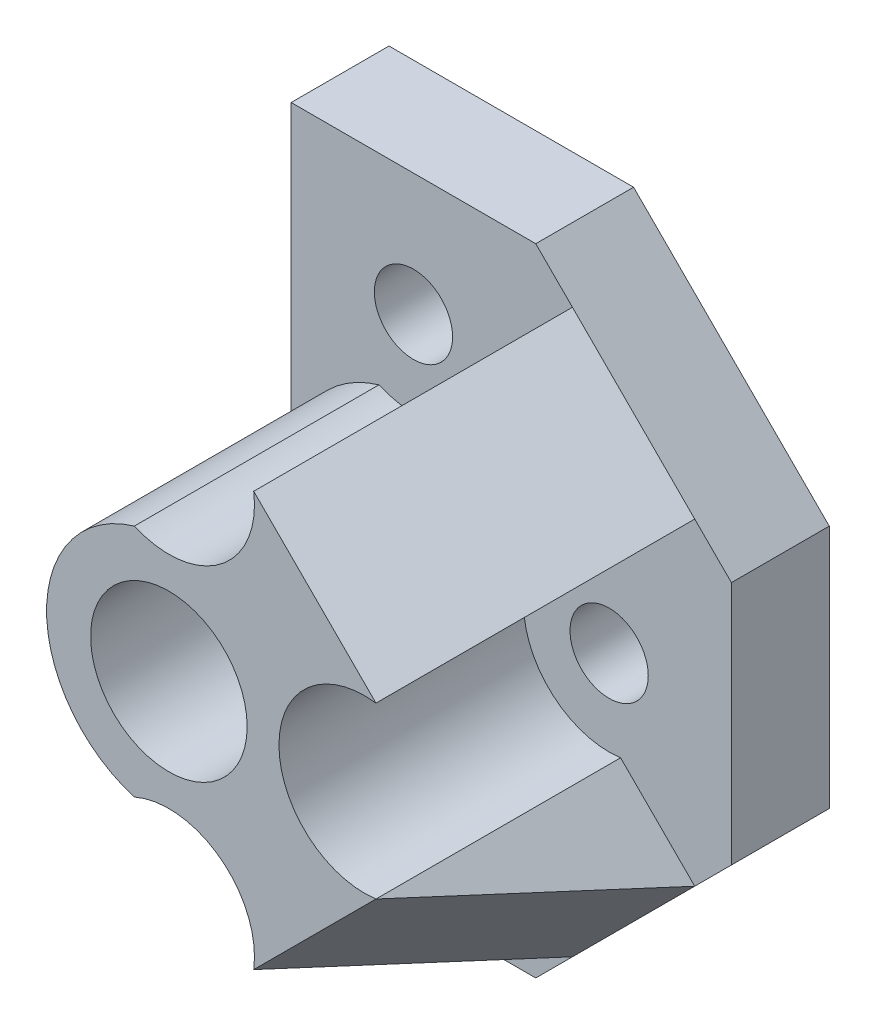
ISO-10303-21;
HEADER;
FILE_DESCRIPTION(('STEP AP214'),'2;1');
FILE_NAME('part.step','',(''),(''),'','','');
FILE_SCHEMA(('AUTOMOTIVE_DESIGN { 1 0 10303 214 1 1 1 1 }'));
ENDSEC;
DATA;
#1=APPLICATION_CONTEXT('core data for automotive mechanical design processes');
#2=APPLICATION_PROTOCOL_DEFINITION('international standard','automotive_design',2000,#1);
#3=PRODUCT_CONTEXT('',#1,'mechanical');
#4=PRODUCT('Part','Part','',(#3));
#5=PRODUCT_RELATED_PRODUCT_CATEGORY('part','',(#4));
#6=PRODUCT_DEFINITION_FORMATION('','',#4);
#7=PRODUCT_DEFINITION_CONTEXT('part definition',#1,'design');
#8=PRODUCT_DEFINITION('design','',#6,#7);
#9=PRODUCT_DEFINITION_SHAPE('','',#8);
#10=(LENGTH_UNIT() NAMED_UNIT(*) SI_UNIT(.MILLI.,.METRE.));
#11=(NAMED_UNIT(*) PLANE_ANGLE_UNIT() SI_UNIT($,.RADIAN.));
#12=(NAMED_UNIT(*) SI_UNIT($,.STERADIAN.) SOLID_ANGLE_UNIT());
#13=UNCERTAINTY_MEASURE_WITH_UNIT(LENGTH_MEASURE(1.E-05),#10,'distance_accuracy_value','');
#14=(GEOMETRIC_REPRESENTATION_CONTEXT(3) GLOBAL_UNCERTAINTY_ASSIGNED_CONTEXT((#13)) GLOBAL_UNIT_ASSIGNED_CONTEXT((#10,
#11,#12)) REPRESENTATION_CONTEXT('',''));
#15=CARTESIAN_POINT('',(0.,0.,0.));
#16=DIRECTION('',(0.,0.,1.));
#17=DIRECTION('',(1.,0.,0.));
#18=AXIS2_PLACEMENT_3D('',#15,#16,#17);
#19=CARTESIAN_POINT('',(0.,0.,4.));
#20=DIRECTION('',(0.,0.,-1.));
#21=DIRECTION('',(-1.,0.,0.));
#22=AXIS2_PLACEMENT_3D('',#19,#20,#21);
#23=PLANE('',#22);
#24=CARTESIAN_POINT('',(5.,5.,4.));
#25=DIRECTION('',(0.,0.,1.));
#26=DIRECTION('',(1.,0.,0.));
#27=AXIS2_PLACEMENT_3D('',#24,#25,#26);
#28=CIRCLE('',#27,1.6);
#29=CARTESIAN_POINT('',(6.6,5.,4.));
#30=VERTEX_POINT('',#29);
#31=EDGE_CURVE('E227',#30,#30,#28,.T.);
#32=ORIENTED_EDGE('',*,*,#31,.F.);
#33=EDGE_LOOP('',(#32));
#34=FACE_BOUND('',#33,.T.);
#35=DIRECTION('',(0.707106781186548,-0.707106781186547,0.));
#36=VECTOR('',#35,1.);
#37=CARTESIAN_POINT('',(8.46850196850295,4.53149803149705,4.));
#38=LINE('',#37,#36);
#39=CARTESIAN_POINT('',(8.46850196850295,4.53149803149705,4.));
#40=VERTEX_POINT('',#39);
#41=CARTESIAN_POINT('',(11.5,1.5,4.));
#42=VERTEX_POINT('',#41);
#43=EDGE_CURVE('E53',#40,#42,#38,.T.);
#44=ORIENTED_EDGE('',*,*,#43,.F.);
#45=CARTESIAN_POINT('',(5.,5.,4.));
#46=DIRECTION('',(0.,0.,-1.));
#47=DIRECTION('',(1.,0.,0.));
#48=AXIS2_PLACEMENT_3D('',#45,#46,#47);
#49=CIRCLE('',#48,3.5);
#50=CARTESIAN_POINT('',(3.58932986337166,8.203125,4.));
#51=VERTEX_POINT('',#50);
#52=EDGE_CURVE('E57',#51,#40,#49,.T.);
#53=ORIENTED_EDGE('',*,*,#52,.F.);
#54=CARTESIAN_POINT('',(5.,13.,4.));
#55=DIRECTION('',(0.,0.,1.));
#56=DIRECTION('',(1.,0.,0.));
#57=AXIS2_PLACEMENT_3D('',#54,#55,#56);
#58=CIRCLE('',#57,5.);
#59=CARTESIAN_POINT('',(0.,13.,4.));
#60=VERTEX_POINT('',#59);
#61=EDGE_CURVE('E11',#60,#51,#58,.T.);
#62=ORIENTED_EDGE('',*,*,#61,.F.);
#63=DIRECTION('',(0.,-1.,0.));
#64=VECTOR('',#63,1.);
#65=CARTESIAN_POINT('',(0.,0.,4.));
#66=LINE('',#65,#64);
#67=CARTESIAN_POINT('',(0.,0.,4.));
#68=VERTEX_POINT('',#67);
#69=EDGE_CURVE('E286',#60,#68,#66,.T.);
#70=ORIENTED_EDGE('',*,*,#69,.T.);
#71=DIRECTION('',(1.,0.,0.));
#72=VECTOR('',#71,1.);
#73=CARTESIAN_POINT('',(10.,0.,4.));
#74=LINE('',#73,#72);
#75=CARTESIAN_POINT('',(10.,0.,4.));
#76=VERTEX_POINT('',#75);
#77=EDGE_CURVE('E242',#68,#76,#74,.T.);
#78=ORIENTED_EDGE('',*,*,#77,.T.);
#79=DIRECTION('',(0.707106781186548,0.707106781186548,0.));
#80=VECTOR('',#79,1.);
#81=CARTESIAN_POINT('',(10.,0.,4.));
#82=LINE('',#81,#80);
#83=EDGE_CURVE('E253',#76,#42,#82,.T.);
#84=ORIENTED_EDGE('',*,*,#83,.T.);
#85=EDGE_LOOP('',(#44,#53,#62,#70,#78,#84));
#86=FACE_BOUND('',#85,.T.);
#87=ADVANCED_FACE('F35',(#34,#86),#23,.F.);
#88=CARTESIAN_POINT('',(5.,21.,4.));
#89=DIRECTION('',(0.,0.,1.));
#90=DIRECTION('',(1.,0.,0.));
#91=AXIS2_PLACEMENT_3D('',#88,#89,#90);
#92=CIRCLE('',#91,1.6);
#93=CARTESIAN_POINT('',(6.6,21.,4.));
#94=VERTEX_POINT('',#93);
#95=EDGE_CURVE('E236',#94,#94,#92,.T.);
#96=ORIENTED_EDGE('',*,*,#95,.F.);
#97=EDGE_LOOP('',(#96));
#98=FACE_BOUND('',#97,.T.);
#99=CARTESIAN_POINT('',(3.58932986337167,17.796875,4.));
#100=VERTEX_POINT('',#99);
#101=EDGE_CURVE('E46',#100,#60,#58,.T.);
#102=ORIENTED_EDGE('',*,*,#101,.F.);
#103=CARTESIAN_POINT('',(5.,21.,4.));
#104=DIRECTION('',(0.,0.,-1.));
#105=DIRECTION('',(1.,0.,0.));
#106=AXIS2_PLACEMENT_3D('',#103,#104,#105);
#107=CIRCLE('',#106,3.5);
#108=CARTESIAN_POINT('',(8.46850196850295,21.468501968503,4.));
#109=VERTEX_POINT('',#108);
#110=EDGE_CURVE('E191',#109,#100,#107,.T.);
#111=ORIENTED_EDGE('',*,*,#110,.F.);
#112=DIRECTION('',(-0.707106781186548,-0.707106781186547,0.));
#113=VECTOR('',#112,1.);
#114=CARTESIAN_POINT('',(11.5,24.5,4.));
#115=LINE('',#114,#113);
#116=CARTESIAN_POINT('',(11.5,24.5,4.));
#117=VERTEX_POINT('',#116);
#118=EDGE_CURVE('E195',#117,#109,#115,.T.);
#119=ORIENTED_EDGE('',*,*,#118,.F.);
#120=DIRECTION('',(-0.707106781186548,0.707106781186548,0.));
#121=VECTOR('',#120,1.);
#122=CARTESIAN_POINT('',(18.,18.,4.));
#123=LINE('',#122,#121);
#124=CARTESIAN_POINT('',(10.,26.,4.));
#125=VERTEX_POINT('',#124);
#126=EDGE_CURVE('E196',#117,#125,#123,.T.);
#127=ORIENTED_EDGE('',*,*,#126,.T.);
#128=DIRECTION('',(-1.,0.,0.));
#129=VECTOR('',#128,1.);
#130=CARTESIAN_POINT('',(0.,26.,4.));
#131=LINE('',#130,#129);
#132=CARTESIAN_POINT('',(0.,26.,4.));
#133=VERTEX_POINT('',#132);
#134=EDGE_CURVE('E287',#125,#133,#131,.T.);
#135=ORIENTED_EDGE('',*,*,#134,.T.);
#136=EDGE_CURVE('E272',#133,#60,#66,.T.);
#137=ORIENTED_EDGE('',*,*,#136,.T.);
#138=EDGE_LOOP('',(#102,#111,#119,#127,#135,#137));
#139=FACE_BOUND('',#138,.T.);
#140=ADVANCED_FACE('F345',(#98,#139),#23,.F.);
#141=CARTESIAN_POINT('',(13.,13.,4.));
#142=DIRECTION('',(0.,0.,1.));
#143=DIRECTION('',(1.,0.,0.));
#144=AXIS2_PLACEMENT_3D('',#141,#142,#143);
#145=CIRCLE('',#144,1.6);
#146=CARTESIAN_POINT('',(14.6,13.,4.));
#147=VERTEX_POINT('',#146);
#148=EDGE_CURVE('E221',#147,#147,#145,.T.);
#149=ORIENTED_EDGE('',*,*,#148,.F.);
#150=EDGE_LOOP('',(#149));
#151=FACE_BOUND('',#150,.T.);
#152=DIRECTION('',(-0.707106781186547,0.707106781186547,0.));
#153=VECTOR('',#152,1.);
#154=CARTESIAN_POINT('',(16.5,6.50000000000001,4.));
#155=LINE('',#154,#153);
#156=CARTESIAN_POINT('',(16.5,6.50000000000001,4.));
#157=VERTEX_POINT('',#156);
#158=CARTESIAN_POINT('',(13.468501968503,9.53149803149705,4.));
#159=VERTEX_POINT('',#158);
#160=EDGE_CURVE('E167',#157,#159,#155,.T.);
#161=ORIENTED_EDGE('',*,*,#160,.F.);
#162=CARTESIAN_POINT('',(18.,8.,4.));
#163=VERTEX_POINT('',#162);
#164=EDGE_CURVE('E245',#157,#163,#82,.T.);
#165=ORIENTED_EDGE('',*,*,#164,.T.);
#166=DIRECTION('',(0.,1.,0.));
#167=VECTOR('',#166,1.);
#168=CARTESIAN_POINT('',(18.,18.,4.));
#169=LINE('',#168,#167);
#170=CARTESIAN_POINT('',(18.,18.,4.));
#171=VERTEX_POINT('',#170);
#172=EDGE_CURVE('E249',#163,#171,#169,.T.);
#173=ORIENTED_EDGE('',*,*,#172,.T.);
#174=CARTESIAN_POINT('',(16.5,19.5,4.));
#175=VERTEX_POINT('',#174);
#176=EDGE_CURVE('E288',#171,#175,#123,.T.);
#177=ORIENTED_EDGE('',*,*,#176,.T.);
#178=DIRECTION('',(0.707106781186548,0.707106781186548,0.));
#179=VECTOR('',#178,1.);
#180=CARTESIAN_POINT('',(13.468501968503,16.468501968503,4.));
#181=LINE('',#180,#179);
#182=CARTESIAN_POINT('',(13.468501968503,16.468501968503,4.));
#183=VERTEX_POINT('',#182);
#184=EDGE_CURVE('E188',#183,#175,#181,.T.);
#185=ORIENTED_EDGE('',*,*,#184,.F.);
#186=CARTESIAN_POINT('',(13.,13.,4.));
#187=DIRECTION('',(0.,0.,-1.));
#188=DIRECTION('',(1.,0.,0.));
#189=AXIS2_PLACEMENT_3D('',#186,#187,#188);
#190=CIRCLE('',#189,3.5);
#191=EDGE_CURVE('E186',#159,#183,#190,.T.);
#192=ORIENTED_EDGE('',*,*,#191,.F.);
#193=EDGE_LOOP('',(#161,#165,#173,#177,#185,#192));
#194=FACE_BOUND('',#193,.T.);
#195=ADVANCED_FACE('F300',(#151,#194),#23,.F.);
#196=CARTESIAN_POINT('',(0.,0.,0.));
#197=DIRECTION('',(0.,0.,-1.));
#198=DIRECTION('',(-1.,0.,0.));
#199=AXIS2_PLACEMENT_3D('',#196,#197,#198);
#200=PLANE('',#199);
#201=CARTESIAN_POINT('',(5.,5.,0.));
#202=DIRECTION('',(0.,0.,1.));
#203=DIRECTION('',(1.,0.,0.));
#204=AXIS2_PLACEMENT_3D('',#201,#202,#203);
#205=CIRCLE('',#204,1.6);
#206=CARTESIAN_POINT('',(6.6,5.,0.));
#207=VERTEX_POINT('',#206);
#208=EDGE_CURVE('E224',#207,#207,#205,.T.);
#209=ORIENTED_EDGE('',*,*,#208,.T.);
#210=EDGE_LOOP('',(#209));
#211=FACE_BOUND('',#210,.T.);
#212=CARTESIAN_POINT('',(5.,21.,0.));
#213=DIRECTION('',(0.,0.,1.));
#214=DIRECTION('',(1.,0.,0.));
#215=AXIS2_PLACEMENT_3D('',#212,#213,#214);
#216=CIRCLE('',#215,1.6);
#217=CARTESIAN_POINT('',(6.6,21.,0.));
#218=VERTEX_POINT('',#217);
#219=EDGE_CURVE('E235',#218,#218,#216,.T.);
#220=ORIENTED_EDGE('',*,*,#219,.T.);
#221=EDGE_LOOP('',(#220));
#222=FACE_BOUND('',#221,.T.);
#223=DIRECTION('',(1.,0.,0.));
#224=VECTOR('',#223,1.);
#225=CARTESIAN_POINT('',(10.,0.,0.));
#226=LINE('',#225,#224);
#227=CARTESIAN_POINT('',(0.,0.,0.));
#228=VERTEX_POINT('',#227);
#229=CARTESIAN_POINT('',(10.,0.,0.));
#230=VERTEX_POINT('',#229);
#231=EDGE_CURVE('E239',#228,#230,#226,.T.);
#232=ORIENTED_EDGE('',*,*,#231,.F.);
#233=DIRECTION('',(0.,-1.,0.));
#234=VECTOR('',#233,1.);
#235=CARTESIAN_POINT('',(0.,0.,0.));
#236=LINE('',#235,#234);
#237=CARTESIAN_POINT('',(0.,26.,0.));
#238=VERTEX_POINT('',#237);
#239=EDGE_CURVE('E246',#238,#228,#236,.T.);
#240=ORIENTED_EDGE('',*,*,#239,.F.);
#241=DIRECTION('',(-1.,0.,0.));
#242=VECTOR('',#241,1.);
#243=CARTESIAN_POINT('',(0.,26.,0.));
#244=LINE('',#243,#242);
#245=CARTESIAN_POINT('',(10.,26.,0.));
#246=VERTEX_POINT('',#245);
#247=EDGE_CURVE('E274',#246,#238,#244,.T.);
#248=ORIENTED_EDGE('',*,*,#247,.F.);
#249=DIRECTION('',(-0.707106781186548,0.707106781186548,0.));
#250=VECTOR('',#249,1.);
#251=CARTESIAN_POINT('',(18.,18.,0.));
#252=LINE('',#251,#250);
#253=CARTESIAN_POINT('',(18.,18.,0.));
#254=VERTEX_POINT('',#253);
#255=EDGE_CURVE('E276',#254,#246,#252,.T.);
#256=ORIENTED_EDGE('',*,*,#255,.F.);
#257=DIRECTION('',(0.,1.,0.));
#258=VECTOR('',#257,1.);
#259=CARTESIAN_POINT('',(18.,18.,0.));
#260=LINE('',#259,#258);
#261=CARTESIAN_POINT('',(18.,8.,0.));
#262=VERTEX_POINT('',#261);
#263=EDGE_CURVE('E278',#262,#254,#260,.T.);
#264=ORIENTED_EDGE('',*,*,#263,.F.);
#265=DIRECTION('',(0.707106781186548,0.707106781186548,0.));
#266=VECTOR('',#265,1.);
#267=CARTESIAN_POINT('',(10.,0.,0.));
#268=LINE('',#267,#266);
#269=EDGE_CURVE('E280',#230,#262,#268,.T.);
#270=ORIENTED_EDGE('',*,*,#269,.F.);
#271=EDGE_LOOP('',(#232,#240,#248,#256,#264,#270));
#272=FACE_BOUND('',#271,.T.);
#273=CARTESIAN_POINT('',(5.,13.,0.));
#274=DIRECTION('',(0.,0.,1.));
#275=DIRECTION('',(1.,0.,0.));
#276=AXIS2_PLACEMENT_3D('',#273,#274,#275);
#277=CIRCLE('',#276,3.2);
#278=CARTESIAN_POINT('',(8.2,13.,0.));
#279=VERTEX_POINT('',#278);
#280=EDGE_CURVE('E230',#279,#279,#277,.T.);
#281=ORIENTED_EDGE('',*,*,#280,.T.);
#282=EDGE_LOOP('',(#281));
#283=FACE_BOUND('',#282,.T.);
#284=CARTESIAN_POINT('',(13.,13.,0.));
#285=DIRECTION('',(0.,0.,1.));
#286=DIRECTION('',(1.,0.,0.));
#287=AXIS2_PLACEMENT_3D('',#284,#285,#286);
#288=CIRCLE('',#287,1.6);
#289=CARTESIAN_POINT('',(14.6,13.,0.));
#290=VERTEX_POINT('',#289);
#291=EDGE_CURVE('E220',#290,#290,#288,.T.);
#292=ORIENTED_EDGE('',*,*,#291,.T.);
#293=EDGE_LOOP('',(#292));
#294=FACE_BOUND('',#293,.T.);
#295=ADVANCED_FACE('F356',(#211,#222,#272,#283,#294),#200,.T.);
#296=CARTESIAN_POINT('',(10.,0.,4.));
#297=DIRECTION('',(0.,1.,0.));
#298=DIRECTION('',(0.,0.,1.));
#299=AXIS2_PLACEMENT_3D('',#296,#297,#298);
#300=PLANE('',#299);
#301=ORIENTED_EDGE('',*,*,#231,.T.);
#302=DIRECTION('',(0.,0.,-1.));
#303=VECTOR('',#302,1.);
#304=CARTESIAN_POINT('',(10.,0.,4.));
#305=LINE('',#304,#303);
#306=EDGE_CURVE('E44',#76,#230,#305,.T.);
#307=ORIENTED_EDGE('',*,*,#306,.F.);
#308=ORIENTED_EDGE('',*,*,#77,.F.);
#309=DIRECTION('',(0.,0.,-1.));
#310=VECTOR('',#309,1.);
#311=CARTESIAN_POINT('',(0.,0.,4.));
#312=LINE('',#311,#310);
#313=EDGE_CURVE('E269',#68,#228,#312,.T.);
#314=ORIENTED_EDGE('',*,*,#313,.T.);
#315=EDGE_LOOP('',(#301,#307,#308,#314));
#316=FACE_BOUND('',#315,.T.);
#317=ADVANCED_FACE('F37',(#316),#300,.F.);
#318=CARTESIAN_POINT('',(10.,0.,4.));
#319=DIRECTION('',(-0.707106781186548,0.707106781186547,0.));
#320=DIRECTION('',(-0.707106781186547,-0.707106781186548,0.));
#321=AXIS2_PLACEMENT_3D('',#318,#319,#320);
#322=PLANE('',#321);
#323=ORIENTED_EDGE('',*,*,#164,.F.);
#324=DIRECTION('',(0.707106781186547,0.707106781186548,0.));
#325=VECTOR('',#324,1.);
#326=CARTESIAN_POINT('',(9.42893218813453,-0.571067811865475,4.));
#327=LINE('',#326,#325);
#328=EDGE_CURVE('E145',#42,#157,#327,.T.);
#329=ORIENTED_EDGE('',*,*,#328,.F.);
#330=ORIENTED_EDGE('',*,*,#83,.F.);
#331=ORIENTED_EDGE('',*,*,#306,.T.);
#332=ORIENTED_EDGE('',*,*,#269,.T.);
#333=DIRECTION('',(0.,0.,-1.));
#334=VECTOR('',#333,1.);
#335=CARTESIAN_POINT('',(18.,8.,4.));
#336=LINE('',#335,#334);
#337=EDGE_CURVE('E257',#163,#262,#336,.T.);
#338=ORIENTED_EDGE('',*,*,#337,.F.);
#339=EDGE_LOOP('',(#323,#329,#330,#331,#332,#338));
#340=FACE_BOUND('',#339,.T.);
#341=ADVANCED_FACE('F369',(#340),#322,.F.);
#342=CARTESIAN_POINT('',(18.,18.,4.));
#343=DIRECTION('',(-1.,0.,0.));
#344=DIRECTION('',(0.,0.,1.));
#345=AXIS2_PLACEMENT_3D('',#342,#343,#344);
#346=PLANE('',#345);
#347=ORIENTED_EDGE('',*,*,#263,.T.);
#348=DIRECTION('',(0.,0.,-1.));
#349=VECTOR('',#348,1.);
#350=CARTESIAN_POINT('',(18.,18.,4.));
#351=LINE('',#350,#349);
#352=EDGE_CURVE('E260',#171,#254,#351,.T.);
#353=ORIENTED_EDGE('',*,*,#352,.F.);
#354=ORIENTED_EDGE('',*,*,#172,.F.);
#355=ORIENTED_EDGE('',*,*,#337,.T.);
#356=EDGE_LOOP('',(#347,#353,#354,#355));
#357=FACE_BOUND('',#356,.T.);
#358=ADVANCED_FACE('F304',(#357),#346,.F.);
#359=CARTESIAN_POINT('',(18.,18.,4.));
#360=DIRECTION('',(-0.707106781186548,-0.707106781186547,0.));
#361=DIRECTION('',(0.707106781186547,-0.707106781186548,0.));
#362=AXIS2_PLACEMENT_3D('',#359,#360,#361);
#363=PLANE('',#362);
#364=ORIENTED_EDGE('',*,*,#126,.F.);
#365=DIRECTION('',(0.707106781186548,-0.707106781186547,0.));
#366=VECTOR('',#365,1.);
#367=CARTESIAN_POINT('',(9.42893218813452,26.5710678118655,4.));
#368=LINE('',#367,#366);
#369=EDGE_CURVE('E310',#117,#175,#368,.T.);
#370=ORIENTED_EDGE('',*,*,#369,.T.);
#371=ORIENTED_EDGE('',*,*,#176,.F.);
#372=ORIENTED_EDGE('',*,*,#352,.T.);
#373=ORIENTED_EDGE('',*,*,#255,.T.);
#374=DIRECTION('',(0.,0.,-1.));
#375=VECTOR('',#374,1.);
#376=CARTESIAN_POINT('',(10.,26.,4.));
#377=LINE('',#376,#375);
#378=EDGE_CURVE('E263',#125,#246,#377,.T.);
#379=ORIENTED_EDGE('',*,*,#378,.F.);
#380=EDGE_LOOP('',(#364,#370,#371,#372,#373,#379));
#381=FACE_BOUND('',#380,.T.);
#382=ADVANCED_FACE('F309',(#381),#363,.F.);
#383=CARTESIAN_POINT('',(0.,26.,4.));
#384=DIRECTION('',(0.,-1.,0.));
#385=DIRECTION('',(0.,0.,-1.));
#386=AXIS2_PLACEMENT_3D('',#383,#384,#385);
#387=PLANE('',#386);
#388=ORIENTED_EDGE('',*,*,#247,.T.);
#389=DIRECTION('',(0.,0.,-1.));
#390=VECTOR('',#389,1.);
#391=CARTESIAN_POINT('',(0.,26.,4.));
#392=LINE('',#391,#390);
#393=EDGE_CURVE('E266',#133,#238,#392,.T.);
#394=ORIENTED_EDGE('',*,*,#393,.F.);
#395=ORIENTED_EDGE('',*,*,#134,.F.);
#396=ORIENTED_EDGE('',*,*,#378,.T.);
#397=EDGE_LOOP('',(#388,#394,#395,#396));
#398=FACE_BOUND('',#397,.T.);
#399=ADVANCED_FACE('F377',(#398),#387,.F.);
#400=CARTESIAN_POINT('',(0.,0.,4.));
#401=DIRECTION('',(1.,0.,0.));
#402=DIRECTION('',(0.,0.,-1.));
#403=AXIS2_PLACEMENT_3D('',#400,#401,#402);
#404=PLANE('',#403);
#405=ORIENTED_EDGE('',*,*,#239,.T.);
#406=ORIENTED_EDGE('',*,*,#313,.F.);
#407=ORIENTED_EDGE('',*,*,#69,.F.);
#408=ORIENTED_EDGE('',*,*,#136,.F.);
#409=ORIENTED_EDGE('',*,*,#393,.T.);
#410=EDGE_LOOP('',(#405,#406,#407,#408,#409));
#411=FACE_BOUND('',#410,.T.);
#412=ADVANCED_FACE('F373',(#411),#404,.F.);
#413=CARTESIAN_POINT('',(5.,21.,4.));
#414=DIRECTION('',(0.,0.,-1.));
#415=DIRECTION('',(-1.,0.,0.));
#416=AXIS2_PLACEMENT_3D('',#413,#414,#415);
#417=CYLINDRICAL_SURFACE('',#416,1.6);
#418=ORIENTED_EDGE('',*,*,#95,.T.);
#419=EDGE_LOOP('',(#418));
#420=FACE_BOUND('',#419,.T.);
#421=ORIENTED_EDGE('',*,*,#219,.F.);
#422=EDGE_LOOP('',(#421));
#423=FACE_BOUND('',#422,.T.);
#424=ADVANCED_FACE('F376',(#420,#423),#417,.F.);
#425=CARTESIAN_POINT('',(5.,13.,4.));
#426=DIRECTION('',(0.,0.,-1.));
#427=DIRECTION('',(-1.,0.,0.));
#428=AXIS2_PLACEMENT_3D('',#425,#426,#427);
#429=CYLINDRICAL_SURFACE('',#428,3.2);
#430=ORIENTED_EDGE('',*,*,#280,.F.);
#431=EDGE_LOOP('',(#430));
#432=FACE_BOUND('',#431,.T.);
#433=CARTESIAN_POINT('',(5.,13.,14.));
#434=DIRECTION('',(0.,0.,1.));
#435=DIRECTION('',(1.,0.,0.));
#436=AXIS2_PLACEMENT_3D('',#433,#434,#435);
#437=CIRCLE('',#436,3.2);
#438=CARTESIAN_POINT('',(8.2,13.,14.));
#439=VERTEX_POINT('',#438);
#440=EDGE_CURVE('E181',#439,#439,#437,.T.);
#441=ORIENTED_EDGE('',*,*,#440,.T.);
#442=EDGE_LOOP('',(#441));
#443=FACE_BOUND('',#442,.T.);
#444=ADVANCED_FACE('F329',(#432,#443),#429,.F.);
#445=CARTESIAN_POINT('',(5.,5.,4.));
#446=DIRECTION('',(0.,0.,-1.));
#447=DIRECTION('',(-1.,0.,0.));
#448=AXIS2_PLACEMENT_3D('',#445,#446,#447);
#449=CYLINDRICAL_SURFACE('',#448,1.6);
#450=ORIENTED_EDGE('',*,*,#31,.T.);
#451=EDGE_LOOP('',(#450));
#452=FACE_BOUND('',#451,.T.);
#453=ORIENTED_EDGE('',*,*,#208,.F.);
#454=EDGE_LOOP('',(#453));
#455=FACE_BOUND('',#454,.T.);
#456=ADVANCED_FACE('F339',(#452,#455),#449,.F.);
#457=CARTESIAN_POINT('',(13.,13.,4.));
#458=DIRECTION('',(0.,0.,-1.));
#459=DIRECTION('',(-1.,0.,0.));
#460=AXIS2_PLACEMENT_3D('',#457,#458,#459);
#461=CYLINDRICAL_SURFACE('',#460,1.6);
#462=ORIENTED_EDGE('',*,*,#148,.T.);
#463=EDGE_LOOP('',(#462));
#464=FACE_BOUND('',#463,.T.);
#465=ORIENTED_EDGE('',*,*,#291,.F.);
#466=EDGE_LOOP('',(#465));
#467=FACE_BOUND('',#466,.T.);
#468=ADVANCED_FACE('F331',(#464,#467),#461,.F.);
#469=CARTESIAN_POINT('',(13.,13.,14.));
#470=DIRECTION('',(0.,0.,1.));
#471=DIRECTION('',(1.,0.,0.));
#472=AXIS2_PLACEMENT_3D('',#469,#470,#471);
#473=PLANE('',#472);
#474=DIRECTION('',(0.707106781186547,0.707106781186548,0.));
#475=VECTOR('',#474,1.);
#476=CARTESIAN_POINT('',(6.39743415663748,2.46043021963157,14.));
#477=LINE('',#476,#475);
#478=CARTESIAN_POINT('',(8.46850196850295,4.53149803149705,14.));
#479=VERTEX_POINT('',#478);
#480=CARTESIAN_POINT('',(13.468501968503,9.53149803149705,14.));
#481=VERTEX_POINT('',#480);
#482=EDGE_CURVE('E142',#479,#481,#477,.T.);
#483=ORIENTED_EDGE('',*,*,#482,.T.);
#484=CARTESIAN_POINT('',(13.,13.,14.));
#485=DIRECTION('',(0.,0.,-1.));
#486=DIRECTION('',(1.,0.,0.));
#487=AXIS2_PLACEMENT_3D('',#484,#485,#486);
#488=CIRCLE('',#487,3.5);
#489=CARTESIAN_POINT('',(13.468501968503,16.468501968503,14.));
#490=VERTEX_POINT('',#489);
#491=EDGE_CURVE('E157',#481,#490,#488,.T.);
#492=ORIENTED_EDGE('',*,*,#491,.T.);
#493=DIRECTION('',(0.707106781186548,-0.707106781186547,0.));
#494=VECTOR('',#493,1.);
#495=CARTESIAN_POINT('',(6.39743415663747,23.5395697803684,14.));
#496=LINE('',#495,#494);
#497=CARTESIAN_POINT('',(8.46850196850295,21.4685019685029,14.));
#498=VERTEX_POINT('',#497);
#499=EDGE_CURVE('E313',#498,#490,#496,.T.);
#500=ORIENTED_EDGE('',*,*,#499,.F.);
#501=CARTESIAN_POINT('',(5.,21.,14.));
#502=DIRECTION('',(0.,0.,-1.));
#503=DIRECTION('',(1.,0.,0.));
#504=AXIS2_PLACEMENT_3D('',#501,#502,#503);
#505=CIRCLE('',#504,3.5);
#506=CARTESIAN_POINT('',(3.58932986337167,17.796875,14.));
#507=VERTEX_POINT('',#506);
#508=EDGE_CURVE('E175',#498,#507,#505,.T.);
#509=ORIENTED_EDGE('',*,*,#508,.T.);
#510=CARTESIAN_POINT('',(5.,13.,14.));
#511=DIRECTION('',(0.,0.,1.));
#512=DIRECTION('',(1.,0.,0.));
#513=AXIS2_PLACEMENT_3D('',#510,#511,#512);
#514=CIRCLE('',#513,5.);
#515=CARTESIAN_POINT('',(3.58932986337166,8.203125,14.));
#516=VERTEX_POINT('',#515);
#517=EDGE_CURVE('E177',#507,#516,#514,.T.);
#518=ORIENTED_EDGE('',*,*,#517,.T.);
#519=CARTESIAN_POINT('',(5.,5.,14.));
#520=DIRECTION('',(0.,0.,-1.));
#521=DIRECTION('',(1.,0.,0.));
#522=AXIS2_PLACEMENT_3D('',#519,#520,#521);
#523=CIRCLE('',#522,3.5);
#524=EDGE_CURVE('E160',#516,#479,#523,.T.);
#525=ORIENTED_EDGE('',*,*,#524,.T.);
#526=EDGE_LOOP('',(#483,#492,#500,#509,#518,#525));
#527=FACE_BOUND('',#526,.T.);
#528=ORIENTED_EDGE('',*,*,#440,.F.);
#529=EDGE_LOOP('',(#528));
#530=FACE_BOUND('',#529,.T.);
#531=ADVANCED_FACE('F153',(#527,#530),#473,.T.);
#532=CARTESIAN_POINT('',(13.,13.,14.));
#533=DIRECTION('',(0.,0.,-1.));
#534=DIRECTION('',(-1.,0.,0.));
#535=AXIS2_PLACEMENT_3D('',#532,#533,#534);
#536=CYLINDRICAL_SURFACE('',#535,3.5);
#537=ORIENTED_EDGE('',*,*,#191,.T.);
#538=DIRECTION('',(0.,0.,-1.));
#539=VECTOR('',#538,1.);
#540=CARTESIAN_POINT('',(13.468501968503,16.468501968503,14.));
#541=LINE('',#540,#539);
#542=EDGE_CURVE('E174',#490,#183,#541,.T.);
#543=ORIENTED_EDGE('',*,*,#542,.F.);
#544=ORIENTED_EDGE('',*,*,#491,.F.);
#545=DIRECTION('',(0.,0.,-1.));
#546=VECTOR('',#545,1.);
#547=CARTESIAN_POINT('',(13.468501968503,9.53149803149705,14.));
#548=LINE('',#547,#546);
#549=EDGE_CURVE('E165',#481,#159,#548,.T.);
#550=ORIENTED_EDGE('',*,*,#549,.T.);
#551=EDGE_LOOP('',(#537,#543,#544,#550));
#552=FACE_BOUND('',#551,.T.);
#553=ADVANCED_FACE('F172',(#552),#536,.F.);
#554=CARTESIAN_POINT('',(13.468501968503,16.468501968503,14.));
#555=DIRECTION('',(-0.707106781186548,0.707106781186548,0.));
#556=DIRECTION('',(-0.707106781186548,-0.707106781186548,0.));
#557=AXIS2_PLACEMENT_3D('',#554,#555,#556);
#558=PLANE('',#557);
#559=ORIENTED_EDGE('',*,*,#184,.T.);
#560=DIRECTION('',(0.278623789686718,0.278623789686718,-0.919096060072734));
#561=VECTOR('',#560,1.);
#562=CARTESIAN_POINT('',(13.468501968503,16.468501968503,14.));
#563=LINE('',#562,#561);
#564=EDGE_CURVE('E314',#490,#175,#563,.T.);
#565=ORIENTED_EDGE('',*,*,#564,.F.);
#566=ORIENTED_EDGE('',*,*,#542,.T.);
#567=EDGE_LOOP('',(#559,#565,#566));
#568=FACE_BOUND('',#567,.T.);
#569=ADVANCED_FACE('F337',(#568),#558,.F.);
#570=CARTESIAN_POINT('',(11.5,24.5,14.));
#571=DIRECTION('',(0.707106781186547,-0.707106781186548,0.));
#572=DIRECTION('',(0.707106781186548,0.707106781186547,0.));
#573=AXIS2_PLACEMENT_3D('',#570,#571,#572);
#574=PLANE('',#573);
#575=DIRECTION('',(0.,0.,-1.));
#576=VECTOR('',#575,1.);
#577=CARTESIAN_POINT('',(8.46850196850295,21.468501968503,14.));
#578=LINE('',#577,#576);
#579=EDGE_CURVE('E216',#498,#109,#578,.T.);
#580=ORIENTED_EDGE('',*,*,#579,.F.);
#581=DIRECTION('',(0.278623789686718,0.278623789686718,-0.919096060072734));
#582=VECTOR('',#581,1.);
#583=CARTESIAN_POINT('',(8.93917972656403,21.939179726564,12.4473756764122));
#584=LINE('',#583,#582);
#585=EDGE_CURVE('E316',#498,#117,#584,.T.);
#586=ORIENTED_EDGE('',*,*,#585,.T.);
#587=ORIENTED_EDGE('',*,*,#118,.T.);
#588=EDGE_LOOP('',(#580,#586,#587));
#589=FACE_BOUND('',#588,.T.);
#590=ADVANCED_FACE('F406',(#589),#574,.F.);
#591=CARTESIAN_POINT('',(5.,21.,14.));
#592=DIRECTION('',(0.,0.,-1.));
#593=DIRECTION('',(-1.,0.,0.));
#594=AXIS2_PLACEMENT_3D('',#591,#592,#593);
#595=CYLINDRICAL_SURFACE('',#594,3.5);
#596=ORIENTED_EDGE('',*,*,#110,.T.);
#597=DIRECTION('',(0.,0.,-1.));
#598=VECTOR('',#597,1.);
#599=CARTESIAN_POINT('',(3.58932986337167,17.796875,14.));
#600=LINE('',#599,#598);
#601=EDGE_CURVE('E213',#507,#100,#600,.T.);
#602=ORIENTED_EDGE('',*,*,#601,.F.);
#603=ORIENTED_EDGE('',*,*,#508,.F.);
#604=ORIENTED_EDGE('',*,*,#579,.T.);
#605=EDGE_LOOP('',(#596,#602,#603,#604));
#606=FACE_BOUND('',#605,.T.);
#607=ADVANCED_FACE('F408',(#606),#595,.F.);
#608=CARTESIAN_POINT('',(5.,13.,14.));
#609=DIRECTION('',(0.,0.,-1.));
#610=DIRECTION('',(-1.,0.,0.));
#611=AXIS2_PLACEMENT_3D('',#608,#609,#610);
#612=CYLINDRICAL_SURFACE('',#611,5.);
#613=ORIENTED_EDGE('',*,*,#101,.T.);
#614=ORIENTED_EDGE('',*,*,#61,.T.);
#615=DIRECTION('',(0.,0.,-1.));
#616=VECTOR('',#615,1.);
#617=CARTESIAN_POINT('',(3.58932986337166,8.203125,14.));
#618=LINE('',#617,#616);
#619=EDGE_CURVE('E210',#516,#51,#618,.T.);
#620=ORIENTED_EDGE('',*,*,#619,.F.);
#621=ORIENTED_EDGE('',*,*,#517,.F.);
#622=ORIENTED_EDGE('',*,*,#601,.T.);
#623=EDGE_LOOP('',(#613,#614,#620,#621,#622));
#624=FACE_BOUND('',#623,.T.);
#625=ADVANCED_FACE('F401',(#624),#612,.T.);
#626=CARTESIAN_POINT('',(5.,5.,14.));
#627=DIRECTION('',(0.,0.,-1.));
#628=DIRECTION('',(-1.,0.,0.));
#629=AXIS2_PLACEMENT_3D('',#626,#627,#628);
#630=CYLINDRICAL_SURFACE('',#629,3.5);
#631=ORIENTED_EDGE('',*,*,#52,.T.);
#632=DIRECTION('',(0.,0.,-1.));
#633=VECTOR('',#632,1.);
#634=CARTESIAN_POINT('',(8.46850196850295,4.53149803149705,14.));
#635=LINE('',#634,#633);
#636=EDGE_CURVE('E170',#479,#40,#635,.T.);
#637=ORIENTED_EDGE('',*,*,#636,.F.);
#638=ORIENTED_EDGE('',*,*,#524,.F.);
#639=ORIENTED_EDGE('',*,*,#619,.T.);
#640=EDGE_LOOP('',(#631,#637,#638,#639));
#641=FACE_BOUND('',#640,.T.);
#642=ADVANCED_FACE('F506',(#641),#630,.F.);
#643=CARTESIAN_POINT('',(8.46850196850295,4.53149803149705,14.));
#644=DIRECTION('',(0.707106781186547,0.707106781186548,0.));
#645=DIRECTION('',(-0.707106781186548,0.707106781186547,0.));
#646=AXIS2_PLACEMENT_3D('',#643,#644,#645);
#647=PLANE('',#646);
#648=ORIENTED_EDGE('',*,*,#43,.T.);
#649=DIRECTION('',(-0.278623789686719,0.278623789686719,0.919096060072734));
#650=VECTOR('',#649,1.);
#651=CARTESIAN_POINT('',(8.46850196850295,4.53149803149705,14.));
#652=LINE('',#651,#650);
#653=EDGE_CURVE('E162',#42,#479,#652,.T.);
#654=ORIENTED_EDGE('',*,*,#653,.T.);
#655=ORIENTED_EDGE('',*,*,#636,.T.);
#656=EDGE_LOOP('',(#648,#654,#655));
#657=FACE_BOUND('',#656,.T.);
#658=ADVANCED_FACE('F514',(#657),#647,.F.);
#659=CARTESIAN_POINT('',(16.5,6.50000000000001,14.));
#660=DIRECTION('',(-0.707106781186548,-0.707106781186548,0.));
#661=DIRECTION('',(0.707106781186548,-0.707106781186548,0.));
#662=AXIS2_PLACEMENT_3D('',#659,#660,#661);
#663=PLANE('',#662);
#664=ORIENTED_EDGE('',*,*,#549,.F.);
#665=DIRECTION('',(-0.278623789686719,0.278623789686719,0.919096060072734));
#666=VECTOR('',#665,1.);
#667=CARTESIAN_POINT('',(16.5,6.5,4.));
#668=LINE('',#667,#666);
#669=EDGE_CURVE('E139',#157,#481,#668,.T.);
#670=ORIENTED_EDGE('',*,*,#669,.F.);
#671=ORIENTED_EDGE('',*,*,#160,.T.);
#672=EDGE_LOOP('',(#664,#670,#671));
#673=FACE_BOUND('',#672,.T.);
#674=ADVANCED_FACE('F166',(#673),#663,.F.);
#675=CARTESIAN_POINT('',(6.39743415663747,23.5395697803684,14.));
#676=DIRECTION('',(-0.649899056639269,-0.649899056639269,-0.394033542174746));
#677=DIRECTION('',(0.707106781186548,-0.707106781186547,0.));
#678=AXIS2_PLACEMENT_3D('',#675,#676,#677);
#679=PLANE('',#678);
#680=ORIENTED_EDGE('',*,*,#499,.T.);
#681=ORIENTED_EDGE('',*,*,#564,.T.);
#682=ORIENTED_EDGE('',*,*,#369,.F.);
#683=ORIENTED_EDGE('',*,*,#585,.F.);
#684=EDGE_LOOP('',(#680,#681,#682,#683));
#685=FACE_BOUND('',#684,.T.);
#686=ADVANCED_FACE('F410',(#685),#679,.F.);
#687=CARTESIAN_POINT('',(9.42893218813453,-0.571067811865475,4.));
#688=DIRECTION('',(-0.649899056639269,0.649899056639268,-0.394033542174747));
#689=DIRECTION('',(-0.707106781186547,-0.707106781186548,0.));
#690=AXIS2_PLACEMENT_3D('',#687,#688,#689);
#691=PLANE('',#690);
#692=ORIENTED_EDGE('',*,*,#328,.T.);
#693=ORIENTED_EDGE('',*,*,#669,.T.);
#694=ORIENTED_EDGE('',*,*,#482,.F.);
#695=ORIENTED_EDGE('',*,*,#653,.F.);
#696=EDGE_LOOP('',(#692,#693,#694,#695));
#697=FACE_BOUND('',#696,.T.);
#698=ADVANCED_FACE('F141',(#697),#691,.F.);
#699=CLOSED_SHELL('',(#87,#140,#195,#295,#317,#341,#358,#382,#399,#412,#424,#444,#456,#468,#531,
#553,#569,#590,#607,#625,#642,#658,#674,#686,#698));
#700=MANIFOLD_SOLID_BREP('B2',#699);
#701=ADVANCED_BREP_SHAPE_REPRESENTATION('',(#18,#700),#14);
#702=SHAPE_DEFINITION_REPRESENTATION(#9,#701);
ENDSEC;
END-ISO-10303-21;
